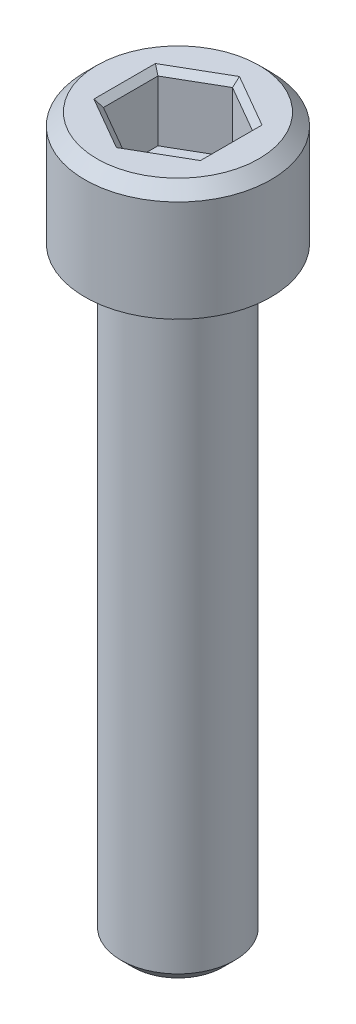
ISO-10303-21;
HEADER;
FILE_DESCRIPTION(('STEP AP214'),'2;1');
FILE_NAME('part.step','',(''),(''),'','','');
FILE_SCHEMA(('AUTOMOTIVE_DESIGN { 1 0 10303 214 1 1 1 1 }'));
ENDSEC;
DATA;
#1=APPLICATION_CONTEXT('core data for automotive mechanical design processes');
#2=APPLICATION_PROTOCOL_DEFINITION('international standard','automotive_design',2000,#1);
#3=PRODUCT_CONTEXT('',#1,'mechanical');
#4=PRODUCT('Part','Part','',(#3));
#5=PRODUCT_RELATED_PRODUCT_CATEGORY('part','',(#4));
#6=PRODUCT_DEFINITION_FORMATION('','',#4);
#7=PRODUCT_DEFINITION_CONTEXT('part definition',#1,'design');
#8=PRODUCT_DEFINITION('design','',#6,#7);
#9=PRODUCT_DEFINITION_SHAPE('','',#8);
#10=(LENGTH_UNIT() NAMED_UNIT(*) SI_UNIT(.MILLI.,.METRE.));
#11=(NAMED_UNIT(*) PLANE_ANGLE_UNIT() SI_UNIT($,.RADIAN.));
#12=(NAMED_UNIT(*) SI_UNIT($,.STERADIAN.) SOLID_ANGLE_UNIT());
#13=UNCERTAINTY_MEASURE_WITH_UNIT(LENGTH_MEASURE(1.E-05),#10,'distance_accuracy_value','');
#14=(GEOMETRIC_REPRESENTATION_CONTEXT(3) GLOBAL_UNCERTAINTY_ASSIGNED_CONTEXT((#13)) GLOBAL_UNIT_ASSIGNED_CONTEXT((#10,
#11,#12)) REPRESENTATION_CONTEXT('',''));
#15=CARTESIAN_POINT('',(0.,0.,0.));
#16=DIRECTION('',(0.,0.,1.));
#17=DIRECTION('',(1.,0.,0.));
#18=AXIS2_PLACEMENT_3D('',#15,#16,#17);
#19=CARTESIAN_POINT('',(-3.96874999999999,-2.794,0.));
#20=DIRECTION('',(0.,-1.,0.));
#21=DIRECTION('',(0.,0.,-1.));
#22=AXIS2_PLACEMENT_3D('',#19,#20,#21);
#23=PLANE('',#22);
#24=DIRECTION('',(-0.866025403784439,0.,0.5));
#25=VECTOR('',#24,1.);
#26=CARTESIAN_POINT('',(1.98437500000001,-2.794,1.14567944042317));
#27=LINE('',#26,#25);
#28=CARTESIAN_POINT('',(1.98437500000001,-2.794,1.14567944042317));
#29=VERTEX_POINT('',#28);
#30=CARTESIAN_POINT('',(0.,-2.794,2.29135888084634));
#31=VERTEX_POINT('',#30);
#32=EDGE_CURVE('E86',#29,#31,#27,.T.);
#33=ORIENTED_EDGE('',*,*,#32,.F.);
#34=DIRECTION('',(0.,0.,1.));
#35=VECTOR('',#34,1.);
#36=CARTESIAN_POINT('',(1.98437500000001,-2.794,-1.14567944042316));
#37=LINE('',#36,#35);
#38=CARTESIAN_POINT('',(1.98437500000001,-2.794,-1.14567944042316));
#39=VERTEX_POINT('',#38);
#40=EDGE_CURVE('E91',#39,#29,#37,.T.);
#41=ORIENTED_EDGE('',*,*,#40,.F.);
#42=DIRECTION('',(0.866025403784439,0.,0.5));
#43=VECTOR('',#42,1.);
#44=CARTESIAN_POINT('',(0.,-2.794,-2.29135888084632));
#45=LINE('',#44,#43);
#46=CARTESIAN_POINT('',(0.,-2.794,-2.29135888084632));
#47=VERTEX_POINT('',#46);
#48=EDGE_CURVE('E176',#47,#39,#45,.T.);
#49=ORIENTED_EDGE('',*,*,#48,.F.);
#50=DIRECTION('',(0.866025403784438,0.,-0.5));
#51=VECTOR('',#50,1.);
#52=CARTESIAN_POINT('',(-1.98437499999999,-2.794,-1.14567944042316));
#53=LINE('',#52,#51);
#54=CARTESIAN_POINT('',(-1.984375,-2.794,-1.14567944042316));
#55=VERTEX_POINT('',#54);
#56=EDGE_CURVE('E182',#55,#47,#53,.T.);
#57=ORIENTED_EDGE('',*,*,#56,.F.);
#58=DIRECTION('',(0.,0.,-1.));
#59=VECTOR('',#58,1.);
#60=CARTESIAN_POINT('',(-1.984375,-2.794,1.14567944042317));
#61=LINE('',#60,#59);
#62=CARTESIAN_POINT('',(-1.984375,-2.794,1.14567944042317));
#63=VERTEX_POINT('',#62);
#64=EDGE_CURVE('E187',#63,#55,#61,.T.);
#65=ORIENTED_EDGE('',*,*,#64,.F.);
#66=DIRECTION('',(-0.866025403784438,0.,-0.5));
#67=VECTOR('',#66,1.);
#68=CARTESIAN_POINT('',(0.,-2.794,2.29135888084634));
#69=LINE('',#68,#67);
#70=EDGE_CURVE('E102',#31,#63,#69,.T.);
#71=ORIENTED_EDGE('',*,*,#70,.F.);
#72=EDGE_LOOP('',(#33,#41,#49,#57,#65,#71));
#73=FACE_BOUND('',#72,.T.);
#74=ADVANCED_FACE('F17',(#73),#23,.F.);
#75=CARTESIAN_POINT('',(1.98437500000001,-2.794,-1.14567944042316));
#76=DIRECTION('',(-1.,0.,0.));
#77=DIRECTION('',(0.,0.,1.));
#78=AXIS2_PLACEMENT_3D('',#75,#76,#77);
#79=PLANE('',#78);
#80=DIRECTION('',(0.,1.,0.));
#81=VECTOR('',#80,1.);
#82=CARTESIAN_POINT('',(1.98437500000001,-2.794,-1.14567944042316));
#83=LINE('',#82,#81);
#84=CARTESIAN_POINT('',(1.98437500000001,-0.254,-1.14567944042316));
#85=VERTEX_POINT('',#84);
#86=EDGE_CURVE('E96',#39,#85,#83,.T.);
#87=ORIENTED_EDGE('',*,*,#86,.F.);
#88=ORIENTED_EDGE('',*,*,#40,.T.);
#89=DIRECTION('',(0.,1.,0.));
#90=VECTOR('',#89,1.);
#91=CARTESIAN_POINT('',(1.98437500000001,-2.794,1.14567944042317));
#92=LINE('',#91,#90);
#93=CARTESIAN_POINT('',(1.98437500000001,-0.254,1.14567944042317));
#94=VERTEX_POINT('',#93);
#95=EDGE_CURVE('E93',#94,#29,#92,.F.);
#96=ORIENTED_EDGE('',*,*,#95,.F.);
#97=DIRECTION('',(0.,0.,1.));
#98=VECTOR('',#97,1.);
#99=CARTESIAN_POINT('',(1.98437500000001,-0.254,0.));
#100=LINE('',#99,#98);
#101=EDGE_CURVE('E174',#94,#85,#100,.F.);
#102=ORIENTED_EDGE('',*,*,#101,.T.);
#103=EDGE_LOOP('',(#87,#88,#96,#102));
#104=FACE_BOUND('',#103,.T.);
#105=ADVANCED_FACE('F92',(#104),#79,.T.);
#106=CARTESIAN_POINT('',(1.98437500000001,-2.794,1.14567944042317));
#107=DIRECTION('',(-0.5,0.,-0.866025403784439));
#108=DIRECTION('',(-0.866025403784439,0.,0.5));
#109=AXIS2_PLACEMENT_3D('',#106,#107,#108);
#110=PLANE('',#109);
#111=ORIENTED_EDGE('',*,*,#95,.T.);
#112=ORIENTED_EDGE('',*,*,#32,.T.);
#113=DIRECTION('',(0.,1.,0.));
#114=VECTOR('',#113,1.);
#115=CARTESIAN_POINT('',(0.,-2.794,2.29135888084634));
#116=LINE('',#115,#114);
#117=CARTESIAN_POINT('',(0.,-0.253999999999999,2.29135888084634));
#118=VERTEX_POINT('',#117);
#119=EDGE_CURVE('E104',#118,#31,#116,.F.);
#120=ORIENTED_EDGE('',*,*,#119,.F.);
#121=DIRECTION('',(0.866025403784439,0.,-0.5));
#122=VECTOR('',#121,1.);
#123=CARTESIAN_POINT('',(0.,-0.253999999999998,2.29135888084634));
#124=LINE('',#123,#122);
#125=EDGE_CURVE('E108',#118,#94,#124,.T.);
#126=ORIENTED_EDGE('',*,*,#125,.T.);
#127=EDGE_LOOP('',(#111,#112,#120,#126));
#128=FACE_BOUND('',#127,.T.);
#129=ADVANCED_FACE('F106',(#128),#110,.T.);
#130=CARTESIAN_POINT('',(0.,-2.794,2.29135888084634));
#131=DIRECTION('',(0.5,0.,-0.866025403784438));
#132=DIRECTION('',(-0.866025403784438,0.,-0.5));
#133=AXIS2_PLACEMENT_3D('',#130,#131,#132);
#134=PLANE('',#133);
#135=ORIENTED_EDGE('',*,*,#119,.T.);
#136=ORIENTED_EDGE('',*,*,#70,.T.);
#137=DIRECTION('',(0.,1.,0.));
#138=VECTOR('',#137,1.);
#139=CARTESIAN_POINT('',(-1.984375,-2.794,1.14567944042317));
#140=LINE('',#139,#138);
#141=CARTESIAN_POINT('',(-1.984375,-0.254,1.14567944042317));
#142=VERTEX_POINT('',#141);
#143=EDGE_CURVE('E189',#142,#63,#140,.F.);
#144=ORIENTED_EDGE('',*,*,#143,.F.);
#145=DIRECTION('',(0.866025403784438,0.,0.500000000000001));
#146=VECTOR('',#145,1.);
#147=CARTESIAN_POINT('',(-1.984375,-0.254,1.14567944042317));
#148=LINE('',#147,#146);
#149=EDGE_CURVE('E168',#142,#118,#148,.T.);
#150=ORIENTED_EDGE('',*,*,#149,.T.);
#151=EDGE_LOOP('',(#135,#136,#144,#150));
#152=FACE_BOUND('',#151,.T.);
#153=ADVANCED_FACE('F193',(#152),#134,.T.);
#154=CARTESIAN_POINT('',(-1.984375,-2.794,1.14567944042317));
#155=DIRECTION('',(1.,0.,0.));
#156=DIRECTION('',(0.,0.,-1.));
#157=AXIS2_PLACEMENT_3D('',#154,#155,#156);
#158=PLANE('',#157);
#159=ORIENTED_EDGE('',*,*,#143,.T.);
#160=ORIENTED_EDGE('',*,*,#64,.T.);
#161=DIRECTION('',(0.,1.,0.));
#162=VECTOR('',#161,1.);
#163=CARTESIAN_POINT('',(-1.984375,-2.794,-1.14567944042316));
#164=LINE('',#163,#162);
#165=CARTESIAN_POINT('',(-1.984375,-0.253999999999999,-1.14567944042316));
#166=VERTEX_POINT('',#165);
#167=EDGE_CURVE('E184',#166,#55,#164,.F.);
#168=ORIENTED_EDGE('',*,*,#167,.F.);
#169=DIRECTION('',(0.,0.,1.));
#170=VECTOR('',#169,1.);
#171=CARTESIAN_POINT('',(-1.984375,-0.254,0.));
#172=LINE('',#171,#170);
#173=EDGE_CURVE('E163',#166,#142,#172,.T.);
#174=ORIENTED_EDGE('',*,*,#173,.T.);
#175=EDGE_LOOP('',(#159,#160,#168,#174));
#176=FACE_BOUND('',#175,.T.);
#177=ADVANCED_FACE('F223',(#176),#158,.T.);
#178=CARTESIAN_POINT('',(-1.98437499999999,-2.794,-1.14567944042316));
#179=DIRECTION('',(0.5,0.,0.866025403784438));
#180=DIRECTION('',(0.866025403784438,0.,-0.5));
#181=AXIS2_PLACEMENT_3D('',#178,#179,#180);
#182=PLANE('',#181);
#183=ORIENTED_EDGE('',*,*,#167,.T.);
#184=ORIENTED_EDGE('',*,*,#56,.T.);
#185=DIRECTION('',(0.,1.,0.));
#186=VECTOR('',#185,1.);
#187=CARTESIAN_POINT('',(0.,-2.794,-2.29135888084632));
#188=LINE('',#187,#186);
#189=CARTESIAN_POINT('',(0.,-0.254,-2.29135888084632));
#190=VERTEX_POINT('',#189);
#191=EDGE_CURVE('E178',#190,#47,#188,.F.);
#192=ORIENTED_EDGE('',*,*,#191,.F.);
#193=DIRECTION('',(-0.866025403784439,0.,0.499999999999999));
#194=VECTOR('',#193,1.);
#195=CARTESIAN_POINT('',(0.,-0.253999999999999,-2.29135888084632));
#196=LINE('',#195,#194);
#197=EDGE_CURVE('E158',#190,#166,#196,.T.);
#198=ORIENTED_EDGE('',*,*,#197,.T.);
#199=EDGE_LOOP('',(#183,#184,#192,#198));
#200=FACE_BOUND('',#199,.T.);
#201=ADVANCED_FACE('F219',(#200),#182,.T.);
#202=CARTESIAN_POINT('',(0.,-2.794,-2.29135888084632));
#203=DIRECTION('',(-0.5,0.,0.866025403784439));
#204=DIRECTION('',(0.866025403784439,0.,0.5));
#205=AXIS2_PLACEMENT_3D('',#202,#203,#204);
#206=PLANE('',#205);
#207=ORIENTED_EDGE('',*,*,#191,.T.);
#208=ORIENTED_EDGE('',*,*,#48,.T.);
#209=ORIENTED_EDGE('',*,*,#86,.T.);
#210=DIRECTION('',(-0.866025403784439,0.,-0.499999999999999));
#211=VECTOR('',#210,1.);
#212=CARTESIAN_POINT('',(1.98437500000001,-0.253999999999997,-1.14567944042316));
#213=LINE('',#212,#211);
#214=EDGE_CURVE('E150',#85,#190,#213,.T.);
#215=ORIENTED_EDGE('',*,*,#214,.T.);
#216=EDGE_LOOP('',(#207,#208,#209,#215));
#217=FACE_BOUND('',#216,.T.);
#218=ADVANCED_FACE('F214',(#217),#206,.T.);
#219=CARTESIAN_POINT('',(2.23837500000001,0.,0.));
#220=DIRECTION('',(0.707106781186548,-0.707106781186548,0.));
#221=DIRECTION('',(0.707106781186548,0.707106781186548,0.));
#222=AXIS2_PLACEMENT_3D('',#219,#220,#221);
#223=PLANE('',#222);
#224=ORIENTED_EDGE('',*,*,#101,.F.);
#225=DIRECTION('',(0.654653670707971,0.654653670707979,0.377964473009234));
#226=VECTOR('',#225,1.);
#227=CARTESIAN_POINT('',(1.98437500000001,-0.254,1.14567944042317));
#228=LINE('',#227,#226);
#229=CARTESIAN_POINT('',(2.23837500000001,0.,1.29232640879734));
#230=VERTEX_POINT('',#229);
#231=EDGE_CURVE('E171',#94,#230,#228,.T.);
#232=ORIENTED_EDGE('',*,*,#231,.T.);
#233=DIRECTION('',(0.,0.,1.));
#234=VECTOR('',#233,1.);
#235=CARTESIAN_POINT('',(2.23837500000001,0.,0.));
#236=LINE('',#235,#234);
#237=CARTESIAN_POINT('',(2.23837500000001,0.,-1.29232640879732));
#238=VERTEX_POINT('',#237);
#239=EDGE_CURVE('E146',#238,#230,#236,.T.);
#240=ORIENTED_EDGE('',*,*,#239,.F.);
#241=DIRECTION('',(-0.654653670707983,-0.654653670707975,0.377964473009222));
#242=VECTOR('',#241,1.);
#243=CARTESIAN_POINT('',(2.23837500000001,0.,-1.29232640879732));
#244=LINE('',#243,#242);
#245=EDGE_CURVE('E153',#238,#85,#244,.T.);
#246=ORIENTED_EDGE('',*,*,#245,.T.);
#247=EDGE_LOOP('',(#224,#232,#240,#246));
#248=FACE_BOUND('',#247,.T.);
#249=ADVANCED_FACE('F209',(#248),#223,.F.);
#250=CARTESIAN_POINT('',(1.11918750000001,0.,1.938489613196));
#251=DIRECTION('',(0.353553390593273,-0.707106781186548,0.612372435695794));
#252=DIRECTION('',(0.,-0.654653670707977,-0.755928946018455));
#253=AXIS2_PLACEMENT_3D('',#250,#251,#252);
#254=PLANE('',#253);
#255=ORIENTED_EDGE('',*,*,#125,.F.);
#256=DIRECTION('',(0.,-0.654653670707977,-0.755928946018455));
#257=VECTOR('',#256,1.);
#258=CARTESIAN_POINT('',(0.,-0.319767857142859,2.21541670079543));
#259=LINE('',#258,#257);
#260=CARTESIAN_POINT('',(0.,0.,2.58465281759467));
#261=VERTEX_POINT('',#260);
#262=EDGE_CURVE('E166',#118,#261,#259,.F.);
#263=ORIENTED_EDGE('',*,*,#262,.T.);
#264=DIRECTION('',(-0.866025403784439,0.,0.5));
#265=VECTOR('',#264,1.);
#266=CARTESIAN_POINT('',(2.23837500000001,0.,1.29232640879734));
#267=LINE('',#266,#265);
#268=EDGE_CURVE('E143',#230,#261,#267,.T.);
#269=ORIENTED_EDGE('',*,*,#268,.F.);
#270=ORIENTED_EDGE('',*,*,#231,.F.);
#271=EDGE_LOOP('',(#255,#263,#269,#270));
#272=FACE_BOUND('',#271,.T.);
#273=ADVANCED_FACE('F200',(#272),#254,.F.);
#274=CARTESIAN_POINT('',(-1.1191875,0.,1.938489613196));
#275=DIRECTION('',(-0.353553390593274,-0.707106781186548,0.612372435695794));
#276=DIRECTION('',(0.,-0.654653670707977,-0.755928946018455));
#277=AXIS2_PLACEMENT_3D('',#274,#275,#276);
#278=PLANE('',#277);
#279=DIRECTION('',(-0.866025403784437,0.,-0.500000000000002));
#280=VECTOR('',#279,1.);
#281=CARTESIAN_POINT('',(0.,0.,2.58465281759467));
#282=LINE('',#281,#280);
#283=CARTESIAN_POINT('',(-2.238375,0.,1.29232640879733));
#284=VERTEX_POINT('',#283);
#285=EDGE_CURVE('E140',#261,#284,#282,.T.);
#286=ORIENTED_EDGE('',*,*,#285,.F.);
#287=ORIENTED_EDGE('',*,*,#262,.F.);
#288=ORIENTED_EDGE('',*,*,#149,.F.);
#289=DIRECTION('',(-0.65465367070798,0.65465367070798,0.377964473009216));
#290=VECTOR('',#289,1.);
#291=CARTESIAN_POINT('',(-1.984375,-0.254,1.14567944042317));
#292=LINE('',#291,#290);
#293=EDGE_CURVE('E161',#142,#284,#292,.T.);
#294=ORIENTED_EDGE('',*,*,#293,.T.);
#295=EDGE_LOOP('',(#286,#287,#288,#294));
#296=FACE_BOUND('',#295,.T.);
#297=ADVANCED_FACE('F203',(#296),#278,.F.);
#298=CARTESIAN_POINT('',(-2.238375,0.,0.));
#299=DIRECTION('',(-0.707106781186548,-0.707106781186548,0.));
#300=DIRECTION('',(0.707106781186548,-0.707106781186548,0.));
#301=AXIS2_PLACEMENT_3D('',#298,#299,#300);
#302=PLANE('',#301);
#303=DIRECTION('',(0.,0.,1.));
#304=VECTOR('',#303,1.);
#305=CARTESIAN_POINT('',(-2.238375,0.,0.));
#306=LINE('',#305,#304);
#307=CARTESIAN_POINT('',(-2.238375,0.,-1.29232640879732));
#308=VERTEX_POINT('',#307);
#309=EDGE_CURVE('E137',#284,#308,#306,.F.);
#310=ORIENTED_EDGE('',*,*,#309,.F.);
#311=ORIENTED_EDGE('',*,*,#293,.F.);
#312=ORIENTED_EDGE('',*,*,#173,.F.);
#313=DIRECTION('',(-0.654653670707983,0.654653670707975,-0.377964473009222));
#314=VECTOR('',#313,1.);
#315=CARTESIAN_POINT('',(-1.984375,-0.253999999999995,-1.14567944042316));
#316=LINE('',#315,#314);
#317=EDGE_CURVE('E156',#166,#308,#316,.T.);
#318=ORIENTED_EDGE('',*,*,#317,.T.);
#319=EDGE_LOOP('',(#310,#311,#312,#318));
#320=FACE_BOUND('',#319,.T.);
#321=ADVANCED_FACE('F221',(#320),#302,.F.);
#322=CARTESIAN_POINT('',(-1.1191875,0.,-1.93848961319598));
#323=DIRECTION('',(-0.353553390593274,-0.707106781186548,-0.612372435695794));
#324=DIRECTION('',(0.,0.654653670707977,-0.755928946018455));
#325=AXIS2_PLACEMENT_3D('',#322,#323,#324);
#326=PLANE('',#325);
#327=ORIENTED_EDGE('',*,*,#197,.F.);
#328=DIRECTION('',(0.,0.654653670707977,-0.755928946018455));
#329=VECTOR('',#328,1.);
#330=CARTESIAN_POINT('',(0.,-0.319767857142856,-2.21541670079542));
#331=LINE('',#330,#329);
#332=CARTESIAN_POINT('',(0.,0.,-2.58465281759465));
#333=VERTEX_POINT('',#332);
#334=EDGE_CURVE('E35',#190,#333,#331,.T.);
#335=ORIENTED_EDGE('',*,*,#334,.T.);
#336=DIRECTION('',(0.866025403784439,0.,-0.499999999999999));
#337=VECTOR('',#336,1.);
#338=CARTESIAN_POINT('',(-2.238375,0.,-1.29232640879732));
#339=LINE('',#338,#337);
#340=EDGE_CURVE('E134',#308,#333,#339,.T.);
#341=ORIENTED_EDGE('',*,*,#340,.F.);
#342=ORIENTED_EDGE('',*,*,#317,.F.);
#343=EDGE_LOOP('',(#327,#335,#341,#342));
#344=FACE_BOUND('',#343,.T.);
#345=ADVANCED_FACE('F216',(#344),#326,.F.);
#346=CARTESIAN_POINT('',(1.1191875,0.,-1.93848961319599));
#347=DIRECTION('',(0.353553390593274,-0.707106781186548,-0.612372435695794));
#348=DIRECTION('',(0.,0.654653670707977,-0.755928946018455));
#349=AXIS2_PLACEMENT_3D('',#346,#347,#348);
#350=PLANE('',#349);
#351=ORIENTED_EDGE('',*,*,#214,.F.);
#352=ORIENTED_EDGE('',*,*,#245,.F.);
#353=DIRECTION('',(0.866025403784439,0.,0.5));
#354=VECTOR('',#353,1.);
#355=CARTESIAN_POINT('',(0.,0.,-2.58465281759465));
#356=LINE('',#355,#354);
#357=EDGE_CURVE('E125',#333,#238,#356,.T.);
#358=ORIENTED_EDGE('',*,*,#357,.F.);
#359=ORIENTED_EDGE('',*,*,#334,.F.);
#360=EDGE_LOOP('',(#351,#352,#358,#359));
#361=FACE_BOUND('',#360,.T.);
#362=ADVANCED_FACE('F212',(#361),#350,.F.);
#363=CARTESIAN_POINT('',(0.,0.,0.));
#364=DIRECTION('',(0.,1.,0.));
#365=DIRECTION('',(0.,0.,1.));
#366=AXIS2_PLACEMENT_3D('',#363,#364,#365);
#367=PLANE('',#366);
#368=CARTESIAN_POINT('',(0.,0.,0.));
#369=DIRECTION('',(0.,-1.,0.));
#370=DIRECTION('',(0.,0.,-1.));
#371=AXIS2_PLACEMENT_3D('',#368,#369,#370);
#372=CIRCLE('',#371,3.40360000006967);
#373=CARTESIAN_POINT('',(0.,0.,-3.40360000006967));
#374=VERTEX_POINT('',#373);
#375=EDGE_CURVE('E20',#374,#374,#372,.T.);
#376=ORIENTED_EDGE('',*,*,#375,.F.);
#377=EDGE_LOOP('',(#376));
#378=FACE_BOUND('',#377,.T.);
#379=ORIENTED_EDGE('',*,*,#340,.T.);
#380=ORIENTED_EDGE('',*,*,#357,.T.);
#381=ORIENTED_EDGE('',*,*,#239,.T.);
#382=ORIENTED_EDGE('',*,*,#268,.T.);
#383=ORIENTED_EDGE('',*,*,#285,.T.);
#384=ORIENTED_EDGE('',*,*,#309,.T.);
#385=EDGE_LOOP('',(#379,#380,#381,#382,#383,#384));
#386=FACE_BOUND('',#385,.T.);
#387=ADVANCED_FACE('F206',(#378,#386),#367,.T.);
#388=CARTESIAN_POINT('',(0.,-0.507999999967979,0.));
#389=DIRECTION('',(0.,-1.,0.));
#390=DIRECTION('',(0.,0.,-1.));
#391=AXIS2_PLACEMENT_3D('',#388,#389,#390);
#392=CONICAL_SURFACE('',#391,3.91160000003765,0.785398163397448);
#393=ORIENTED_EDGE('',*,*,#375,.T.);
#394=EDGE_LOOP('',(#393));
#395=FACE_BOUND('',#394,.T.);
#396=CARTESIAN_POINT('',(0.,-0.508,0.));
#397=DIRECTION('',(0.,-1.,0.));
#398=DIRECTION('',(0.,0.,-1.));
#399=AXIS2_PLACEMENT_3D('',#396,#397,#398);
#400=CIRCLE('',#399,3.9116);
#401=CARTESIAN_POINT('',(0.,-0.508,-3.9116));
#402=VERTEX_POINT('',#401);
#403=EDGE_CURVE('E117',#402,#402,#400,.T.);
#404=ORIENTED_EDGE('',*,*,#403,.F.);
#405=EDGE_LOOP('',(#404));
#406=FACE_BOUND('',#405,.T.);
#407=ADVANCED_FACE('F257',(#395,#406),#392,.T.);
#408=CARTESIAN_POINT('',(0.,-30.1752,0.));
#409=DIRECTION('',(0.,1.,0.));
#410=DIRECTION('',(0.,0.,1.));
#411=AXIS2_PLACEMENT_3D('',#408,#409,#410);
#412=PLANE('',#411);
#413=CARTESIAN_POINT('',(0.,-30.1752000000306,0.));
#414=DIRECTION('',(0.,1.,0.));
#415=DIRECTION('',(0.,0.,1.));
#416=AXIS2_PLACEMENT_3D('',#413,#414,#415);
#417=CIRCLE('',#416,1.87959999999521);
#418=CARTESIAN_POINT('',(0.,-30.1752000000306,1.87959999999521));
#419=VERTEX_POINT('',#418);
#420=EDGE_CURVE('E115',#419,#419,#417,.T.);
#421=ORIENTED_EDGE('',*,*,#420,.F.);
#422=EDGE_LOOP('',(#421));
#423=FACE_BOUND('',#422,.T.);
#424=ADVANCED_FACE('F253',(#423),#412,.F.);
#425=CARTESIAN_POINT('',(0.,-4.7752,0.));
#426=DIRECTION('',(0.,-1.,0.));
#427=DIRECTION('',(0.,0.,-1.));
#428=AXIS2_PLACEMENT_3D('',#425,#426,#427);
#429=CYLINDRICAL_SURFACE('',#428,3.9116);
#430=CARTESIAN_POINT('',(0.,-4.7752,0.));
#431=DIRECTION('',(0.,-1.,0.));
#432=DIRECTION('',(0.,0.,-1.));
#433=AXIS2_PLACEMENT_3D('',#430,#431,#432);
#434=CIRCLE('',#433,3.9116);
#435=CARTESIAN_POINT('',(0.,-4.7752,-3.9116));
#436=VERTEX_POINT('',#435);
#437=EDGE_CURVE('E113',#436,#436,#434,.F.);
#438=ORIENTED_EDGE('',*,*,#437,.T.);
#439=EDGE_LOOP('',(#438));
#440=FACE_BOUND('',#439,.T.);
#441=ORIENTED_EDGE('',*,*,#403,.T.);
#442=EDGE_LOOP('',(#441));
#443=FACE_BOUND('',#442,.T.);
#444=ADVANCED_FACE('F249',(#440,#443),#429,.T.);
#445=CARTESIAN_POINT('',(0.,-29.6672000000626,0.));
#446=DIRECTION('',(0.,1.,0.));
#447=DIRECTION('',(0.,0.,1.));
#448=AXIS2_PLACEMENT_3D('',#445,#446,#447);
#449=CONICAL_SURFACE('',#448,2.38759999996319,0.785398163397448);
#450=CARTESIAN_POINT('',(0.,-29.6672,0.));
#451=DIRECTION('',(0.,-1.,0.));
#452=DIRECTION('',(0.,0.,-1.));
#453=AXIS2_PLACEMENT_3D('',#450,#451,#452);
#454=CIRCLE('',#453,2.3876);
#455=CARTESIAN_POINT('',(0.,-29.6672,-2.3876));
#456=VERTEX_POINT('',#455);
#457=EDGE_CURVE('E26',#456,#456,#454,.F.);
#458=ORIENTED_EDGE('',*,*,#457,.F.);
#459=EDGE_LOOP('',(#458));
#460=FACE_BOUND('',#459,.T.);
#461=ORIENTED_EDGE('',*,*,#420,.T.);
#462=EDGE_LOOP('',(#461));
#463=FACE_BOUND('',#462,.T.);
#464=ADVANCED_FACE('F242',(#460,#463),#449,.T.);
#465=CARTESIAN_POINT('',(0.,-4.7752,0.));
#466=DIRECTION('',(0.,1.,0.));
#467=DIRECTION('',(0.,0.,1.));
#468=AXIS2_PLACEMENT_3D('',#465,#466,#467);
#469=PLANE('',#468);
#470=ORIENTED_EDGE('',*,*,#437,.F.);
#471=EDGE_LOOP('',(#470));
#472=FACE_BOUND('',#471,.T.);
#473=CARTESIAN_POINT('',(0.,-4.7752,0.));
#474=DIRECTION('',(0.,-1.,0.));
#475=DIRECTION('',(0.,0.,-1.));
#476=AXIS2_PLACEMENT_3D('',#473,#474,#475);
#477=CIRCLE('',#476,2.3876);
#478=CARTESIAN_POINT('',(0.,-4.7752,-2.3876));
#479=VERTEX_POINT('',#478);
#480=EDGE_CURVE('E11',#479,#479,#477,.T.);
#481=ORIENTED_EDGE('',*,*,#480,.F.);
#482=EDGE_LOOP('',(#481));
#483=FACE_BOUND('',#482,.T.);
#484=ADVANCED_FACE('F236',(#472,#483),#469,.F.);
#485=CARTESIAN_POINT('',(0.,-30.1752,0.));
#486=DIRECTION('',(0.,-1.,0.));
#487=DIRECTION('',(0.,0.,-1.));
#488=AXIS2_PLACEMENT_3D('',#485,#486,#487);
#489=CYLINDRICAL_SURFACE('',#488,2.3876);
#490=ORIENTED_EDGE('',*,*,#480,.T.);
#491=EDGE_LOOP('',(#490));
#492=FACE_BOUND('',#491,.T.);
#493=ORIENTED_EDGE('',*,*,#457,.T.);
#494=EDGE_LOOP('',(#493));
#495=FACE_BOUND('',#494,.T.);
#496=ADVANCED_FACE('F234',(#492,#495),#489,.T.);
#497=CLOSED_SHELL('',(#74,#105,#129,#153,#177,#201,#218,#249,#273,#297,#321,#345,#362,#387,#407,
#424,#444,#464,#484,#496));
#498=MANIFOLD_SOLID_BREP('B1',#497);
#499=ADVANCED_BREP_SHAPE_REPRESENTATION('',(#18,#498),#14);
#500=SHAPE_DEFINITION_REPRESENTATION(#9,#499);
ENDSEC;
END-ISO-10303-21;
